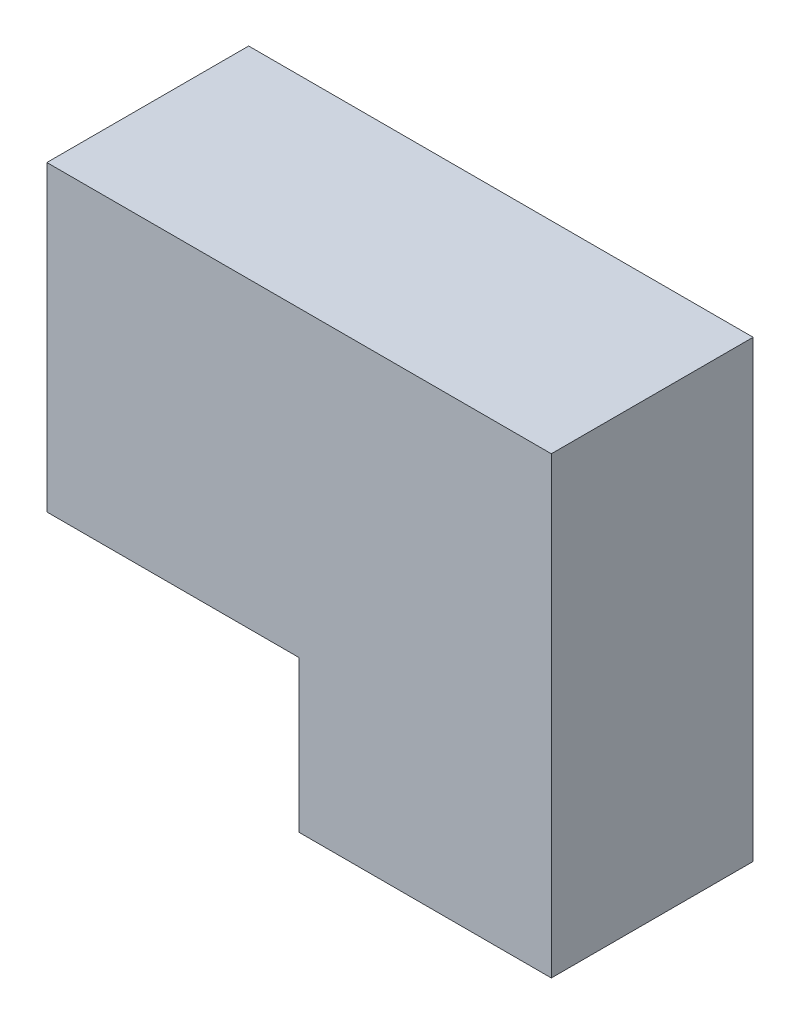
ISO-10303-21;
HEADER;
FILE_DESCRIPTION(('STEP AP214'),'2;1');
FILE_NAME('part.step','',(''),(''),'','','');
FILE_SCHEMA(('AUTOMOTIVE_DESIGN { 1 0 10303 214 1 1 1 1 }'));
ENDSEC;
DATA;
#1=APPLICATION_CONTEXT('core data for automotive mechanical design processes');
#2=APPLICATION_PROTOCOL_DEFINITION('international standard','automotive_design',2000,#1);
#3=PRODUCT_CONTEXT('',#1,'mechanical');
#4=PRODUCT('Part','Part','',(#3));
#5=PRODUCT_RELATED_PRODUCT_CATEGORY('part','',(#4));
#6=PRODUCT_DEFINITION_FORMATION('','',#4);
#7=PRODUCT_DEFINITION_CONTEXT('part definition',#1,'design');
#8=PRODUCT_DEFINITION('design','',#6,#7);
#9=PRODUCT_DEFINITION_SHAPE('','',#8);
#10=(LENGTH_UNIT() NAMED_UNIT(*) SI_UNIT(.MILLI.,.METRE.));
#11=(NAMED_UNIT(*) PLANE_ANGLE_UNIT() SI_UNIT($,.RADIAN.));
#12=(NAMED_UNIT(*) SI_UNIT($,.STERADIAN.) SOLID_ANGLE_UNIT());
#13=UNCERTAINTY_MEASURE_WITH_UNIT(LENGTH_MEASURE(1.E-05),#10,'distance_accuracy_value','');
#14=(GEOMETRIC_REPRESENTATION_CONTEXT(3) GLOBAL_UNCERTAINTY_ASSIGNED_CONTEXT((#13)) GLOBAL_UNIT_ASSIGNED_CONTEXT((#10,
#11,#12)) REPRESENTATION_CONTEXT('',''));
#15=CARTESIAN_POINT('',(0.,0.,0.));
#16=DIRECTION('',(0.,0.,1.));
#17=DIRECTION('',(1.,0.,0.));
#18=AXIS2_PLACEMENT_3D('',#15,#16,#17);
#19=CARTESIAN_POINT('',(5.,0.,4.));
#20=DIRECTION('',(0.,1.,0.));
#21=DIRECTION('',(-1.,0.,0.));
#22=AXIS2_PLACEMENT_3D('',#19,#20,#21);
#23=PLANE('',#22);
#24=DIRECTION('',(1.,0.,0.));
#25=VECTOR('',#24,1.);
#26=CARTESIAN_POINT('',(5.,0.,0.));
#27=LINE('',#26,#25);
#28=CARTESIAN_POINT('',(0.,0.,0.));
#29=VERTEX_POINT('',#28);
#30=CARTESIAN_POINT('',(5.,0.,0.));
#31=VERTEX_POINT('',#30);
#32=EDGE_CURVE('E117',#29,#31,#27,.T.);
#33=ORIENTED_EDGE('',*,*,#32,.T.);
#34=DIRECTION('',(0.,0.,-1.));
#35=VECTOR('',#34,1.);
#36=CARTESIAN_POINT('',(5.,0.,4.));
#37=LINE('',#36,#35);
#38=CARTESIAN_POINT('',(5.,0.,4.));
#39=VERTEX_POINT('',#38);
#40=EDGE_CURVE('E11',#39,#31,#37,.T.);
#41=ORIENTED_EDGE('',*,*,#40,.F.);
#42=DIRECTION('',(1.,0.,0.));
#43=VECTOR('',#42,1.);
#44=CARTESIAN_POINT('',(5.,0.,4.));
#45=LINE('',#44,#43);
#46=CARTESIAN_POINT('',(0.,0.,4.));
#47=VERTEX_POINT('',#46);
#48=EDGE_CURVE('E127',#47,#39,#45,.T.);
#49=ORIENTED_EDGE('',*,*,#48,.F.);
#50=DIRECTION('',(0.,0.,-1.));
#51=VECTOR('',#50,1.);
#52=CARTESIAN_POINT('',(0.,0.,4.));
#53=LINE('',#52,#51);
#54=EDGE_CURVE('E113',#47,#29,#53,.T.);
#55=ORIENTED_EDGE('',*,*,#54,.T.);
#56=EDGE_LOOP('',(#33,#41,#49,#55));
#57=FACE_BOUND('',#56,.T.);
#58=ADVANCED_FACE('F33',(#57),#23,.F.);
#59=CARTESIAN_POINT('',(5.,9.,4.));
#60=DIRECTION('',(-1.,0.,0.));
#61=DIRECTION('',(0.,-1.,0.));
#62=AXIS2_PLACEMENT_3D('',#59,#60,#61);
#63=PLANE('',#62);
#64=DIRECTION('',(0.,1.,0.));
#65=VECTOR('',#64,1.);
#66=CARTESIAN_POINT('',(5.,9.,0.));
#67=LINE('',#66,#65);
#68=CARTESIAN_POINT('',(5.,9.,0.));
#69=VERTEX_POINT('',#68);
#70=EDGE_CURVE('E120',#31,#69,#67,.T.);
#71=ORIENTED_EDGE('',*,*,#70,.T.);
#72=DIRECTION('',(0.,0.,-1.));
#73=VECTOR('',#72,1.);
#74=CARTESIAN_POINT('',(5.,9.,4.));
#75=LINE('',#74,#73);
#76=CARTESIAN_POINT('',(5.,9.,4.));
#77=VERTEX_POINT('',#76);
#78=EDGE_CURVE('E41',#77,#69,#75,.T.);
#79=ORIENTED_EDGE('',*,*,#78,.F.);
#80=DIRECTION('',(0.,1.,0.));
#81=VECTOR('',#80,1.);
#82=CARTESIAN_POINT('',(5.,9.,4.));
#83=LINE('',#82,#81);
#84=EDGE_CURVE('E86',#39,#77,#83,.T.);
#85=ORIENTED_EDGE('',*,*,#84,.F.);
#86=ORIENTED_EDGE('',*,*,#40,.T.);
#87=EDGE_LOOP('',(#71,#79,#85,#86));
#88=FACE_BOUND('',#87,.T.);
#89=ADVANCED_FACE('F151',(#88),#63,.F.);
#90=CARTESIAN_POINT('',(-5.,9.,4.));
#91=DIRECTION('',(0.,-1.,0.));
#92=DIRECTION('',(0.,0.,-1.));
#93=AXIS2_PLACEMENT_3D('',#90,#91,#92);
#94=PLANE('',#93);
#95=DIRECTION('',(-1.,0.,0.));
#96=VECTOR('',#95,1.);
#97=CARTESIAN_POINT('',(-5.,9.,0.));
#98=LINE('',#97,#96);
#99=CARTESIAN_POINT('',(-5.,9.,0.));
#100=VERTEX_POINT('',#99);
#101=EDGE_CURVE('E122',#69,#100,#98,.T.);
#102=ORIENTED_EDGE('',*,*,#101,.T.);
#103=DIRECTION('',(0.,0.,-1.));
#104=VECTOR('',#103,1.);
#105=CARTESIAN_POINT('',(-5.,9.,4.));
#106=LINE('',#105,#104);
#107=CARTESIAN_POINT('',(-5.,9.,4.));
#108=VERTEX_POINT('',#107);
#109=EDGE_CURVE('E108',#108,#100,#106,.T.);
#110=ORIENTED_EDGE('',*,*,#109,.F.);
#111=DIRECTION('',(-1.,0.,0.));
#112=VECTOR('',#111,1.);
#113=CARTESIAN_POINT('',(-5.,9.,4.));
#114=LINE('',#113,#112);
#115=EDGE_CURVE('E99',#77,#108,#114,.T.);
#116=ORIENTED_EDGE('',*,*,#115,.F.);
#117=ORIENTED_EDGE('',*,*,#78,.T.);
#118=EDGE_LOOP('',(#102,#110,#116,#117));
#119=FACE_BOUND('',#118,.T.);
#120=ADVANCED_FACE('F133',(#119),#94,.F.);
#121=CARTESIAN_POINT('',(-5.,3.,4.));
#122=DIRECTION('',(1.,0.,0.));
#123=DIRECTION('',(0.,0.,-1.));
#124=AXIS2_PLACEMENT_3D('',#121,#122,#123);
#125=PLANE('',#124);
#126=DIRECTION('',(0.,-1.,0.));
#127=VECTOR('',#126,1.);
#128=CARTESIAN_POINT('',(-5.,3.,0.));
#129=LINE('',#128,#127);
#130=CARTESIAN_POINT('',(-5.,3.,0.));
#131=VERTEX_POINT('',#130);
#132=EDGE_CURVE('E107',#100,#131,#129,.T.);
#133=ORIENTED_EDGE('',*,*,#132,.T.);
#134=DIRECTION('',(0.,0.,-1.));
#135=VECTOR('',#134,1.);
#136=CARTESIAN_POINT('',(-5.,3.,4.));
#137=LINE('',#136,#135);
#138=CARTESIAN_POINT('',(-5.,3.,4.));
#139=VERTEX_POINT('',#138);
#140=EDGE_CURVE('E104',#139,#131,#137,.T.);
#141=ORIENTED_EDGE('',*,*,#140,.F.);
#142=DIRECTION('',(0.,-1.,0.));
#143=VECTOR('',#142,1.);
#144=CARTESIAN_POINT('',(-5.,3.,4.));
#145=LINE('',#144,#143);
#146=EDGE_CURVE('E93',#108,#139,#145,.T.);
#147=ORIENTED_EDGE('',*,*,#146,.F.);
#148=ORIENTED_EDGE('',*,*,#109,.T.);
#149=EDGE_LOOP('',(#133,#141,#147,#148));
#150=FACE_BOUND('',#149,.T.);
#151=ADVANCED_FACE('F105',(#150),#125,.F.);
#152=CARTESIAN_POINT('',(0.,3.,4.));
#153=DIRECTION('',(0.,1.,0.));
#154=DIRECTION('',(-1.,0.,0.));
#155=AXIS2_PLACEMENT_3D('',#152,#153,#154);
#156=PLANE('',#155);
#157=DIRECTION('',(1.,0.,0.));
#158=VECTOR('',#157,1.);
#159=CARTESIAN_POINT('',(0.,3.,0.));
#160=LINE('',#159,#158);
#161=CARTESIAN_POINT('',(0.,3.,0.));
#162=VERTEX_POINT('',#161);
#163=EDGE_CURVE('E72',#131,#162,#160,.T.);
#164=ORIENTED_EDGE('',*,*,#163,.T.);
#165=DIRECTION('',(0.,0.,-1.));
#166=VECTOR('',#165,1.);
#167=CARTESIAN_POINT('',(0.,3.,4.));
#168=LINE('',#167,#166);
#169=CARTESIAN_POINT('',(0.,3.,4.));
#170=VERTEX_POINT('',#169);
#171=EDGE_CURVE('E109',#170,#162,#168,.T.);
#172=ORIENTED_EDGE('',*,*,#171,.F.);
#173=DIRECTION('',(1.,0.,0.));
#174=VECTOR('',#173,1.);
#175=CARTESIAN_POINT('',(0.,3.,4.));
#176=LINE('',#175,#174);
#177=EDGE_CURVE('E97',#139,#170,#176,.T.);
#178=ORIENTED_EDGE('',*,*,#177,.F.);
#179=ORIENTED_EDGE('',*,*,#140,.T.);
#180=EDGE_LOOP('',(#164,#172,#178,#179));
#181=FACE_BOUND('',#180,.T.);
#182=ADVANCED_FACE('F111',(#181),#156,.F.);
#183=CARTESIAN_POINT('',(0.,0.,4.));
#184=DIRECTION('',(1.,0.,0.));
#185=DIRECTION('',(0.,0.,-1.));
#186=AXIS2_PLACEMENT_3D('',#183,#184,#185);
#187=PLANE('',#186);
#188=DIRECTION('',(0.,-1.,0.));
#189=VECTOR('',#188,1.);
#190=CARTESIAN_POINT('',(0.,0.,0.));
#191=LINE('',#190,#189);
#192=EDGE_CURVE('E78',#162,#29,#191,.T.);
#193=ORIENTED_EDGE('',*,*,#192,.T.);
#194=ORIENTED_EDGE('',*,*,#54,.F.);
#195=DIRECTION('',(0.,-1.,0.));
#196=VECTOR('',#195,1.);
#197=CARTESIAN_POINT('',(0.,0.,4.));
#198=LINE('',#197,#196);
#199=EDGE_CURVE('E49',#170,#47,#198,.T.);
#200=ORIENTED_EDGE('',*,*,#199,.F.);
#201=ORIENTED_EDGE('',*,*,#171,.T.);
#202=EDGE_LOOP('',(#193,#194,#200,#201));
#203=FACE_BOUND('',#202,.T.);
#204=ADVANCED_FACE('F140',(#203),#187,.F.);
#205=CARTESIAN_POINT('',(0.,0.,4.));
#206=DIRECTION('',(0.,0.,-1.));
#207=DIRECTION('',(-1.,0.,0.));
#208=AXIS2_PLACEMENT_3D('',#205,#206,#207);
#209=PLANE('',#208);
#210=ORIENTED_EDGE('',*,*,#48,.T.);
#211=ORIENTED_EDGE('',*,*,#84,.T.);
#212=ORIENTED_EDGE('',*,*,#115,.T.);
#213=ORIENTED_EDGE('',*,*,#146,.T.);
#214=ORIENTED_EDGE('',*,*,#177,.T.);
#215=ORIENTED_EDGE('',*,*,#199,.T.);
#216=EDGE_LOOP('',(#210,#211,#212,#213,#214,#215));
#217=FACE_BOUND('',#216,.T.);
#218=ADVANCED_FACE('F95',(#217),#209,.F.);
#219=CARTESIAN_POINT('',(0.,0.,0.));
#220=DIRECTION('',(0.,0.,-1.));
#221=DIRECTION('',(-1.,0.,0.));
#222=AXIS2_PLACEMENT_3D('',#219,#220,#221);
#223=PLANE('',#222);
#224=ORIENTED_EDGE('',*,*,#32,.F.);
#225=ORIENTED_EDGE('',*,*,#192,.F.);
#226=ORIENTED_EDGE('',*,*,#163,.F.);
#227=ORIENTED_EDGE('',*,*,#132,.F.);
#228=ORIENTED_EDGE('',*,*,#101,.F.);
#229=ORIENTED_EDGE('',*,*,#70,.F.);
#230=EDGE_LOOP('',(#224,#225,#226,#227,#228,#229));
#231=FACE_BOUND('',#230,.T.);
#232=ADVANCED_FACE('F136',(#231),#223,.T.);
#233=CLOSED_SHELL('',(#58,#89,#120,#151,#182,#204,#218,#232));
#234=MANIFOLD_SOLID_BREP('B2',#233);
#235=ADVANCED_BREP_SHAPE_REPRESENTATION('',(#18,#234),#14);
#236=SHAPE_DEFINITION_REPRESENTATION(#9,#235);
ENDSEC;
END-ISO-10303-21;
